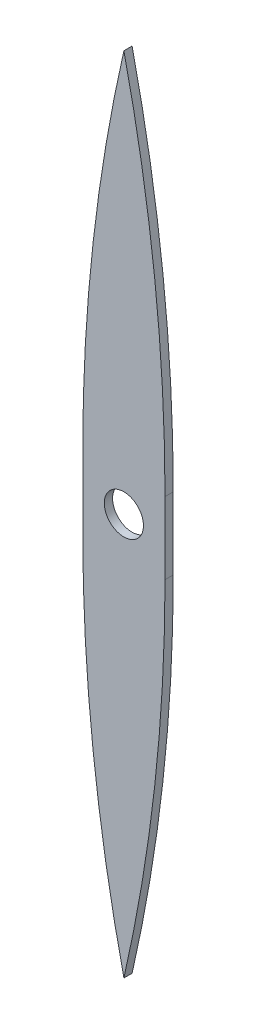
ISO-10303-21;
HEADER;
FILE_DESCRIPTION(('STEP AP214'),'2;1');
FILE_NAME('part.step','',(''),(''),'','','');
FILE_SCHEMA(('AUTOMOTIVE_DESIGN { 1 0 10303 214 1 1 1 1 }'));
ENDSEC;
DATA;
#1=APPLICATION_CONTEXT('core data for automotive mechanical design processes');
#2=APPLICATION_PROTOCOL_DEFINITION('international standard','automotive_design',2000,#1);
#3=PRODUCT_CONTEXT('',#1,'mechanical');
#4=PRODUCT('Part','Part','',(#3));
#5=PRODUCT_RELATED_PRODUCT_CATEGORY('part','',(#4));
#6=PRODUCT_DEFINITION_FORMATION('','',#4);
#7=PRODUCT_DEFINITION_CONTEXT('part definition',#1,'design');
#8=PRODUCT_DEFINITION('design','',#6,#7);
#9=PRODUCT_DEFINITION_SHAPE('','',#8);
#10=(LENGTH_UNIT() NAMED_UNIT(*) SI_UNIT(.MILLI.,.METRE.));
#11=(NAMED_UNIT(*) PLANE_ANGLE_UNIT() SI_UNIT($,.RADIAN.));
#12=(NAMED_UNIT(*) SI_UNIT($,.STERADIAN.) SOLID_ANGLE_UNIT());
#13=UNCERTAINTY_MEASURE_WITH_UNIT(LENGTH_MEASURE(1.E-05),#10,'distance_accuracy_value','');
#14=(GEOMETRIC_REPRESENTATION_CONTEXT(3) GLOBAL_UNCERTAINTY_ASSIGNED_CONTEXT((#13)) GLOBAL_UNIT_ASSIGNED_CONTEXT((#10,
#11,#12)) REPRESENTATION_CONTEXT('',''));
#15=CARTESIAN_POINT('',(0.,0.,0.));
#16=DIRECTION('',(0.,0.,1.));
#17=DIRECTION('',(1.,0.,0.));
#18=AXIS2_PLACEMENT_3D('',#15,#16,#17);
#19=CARTESIAN_POINT('',(-390.,13.8203629652415,2.));
#20=DIRECTION('',(0.,0.,-1.));
#21=DIRECTION('',(-1.,0.,0.));
#22=AXIS2_PLACEMENT_3D('',#19,#20,#21);
#23=CYLINDRICAL_SURFACE('',#22,400.);
#24=CARTESIAN_POINT('',(-390.,13.8203629652415,0.));
#25=DIRECTION('',(0.,0.,1.));
#26=DIRECTION('',(1.,0.,0.));
#27=AXIS2_PLACEMENT_3D('',#24,#25,#26);
#28=CIRCLE('',#27,400.);
#29=CARTESIAN_POINT('',(10.,13.8203629652415,0.));
#30=VERTEX_POINT('',#29);
#31=CARTESIAN_POINT('',(0.,102.702307138397,0.));
#32=VERTEX_POINT('',#31);
#33=EDGE_CURVE('E137',#30,#32,#28,.T.);
#34=ORIENTED_EDGE('',*,*,#33,.T.);
#35=DIRECTION('',(0.,0.,-1.));
#36=VECTOR('',#35,1.);
#37=CARTESIAN_POINT('',(0.,102.702307138397,2.));
#38=LINE('',#37,#36);
#39=CARTESIAN_POINT('',(0.,102.702307138397,2.));
#40=VERTEX_POINT('',#39);
#41=EDGE_CURVE('E11',#40,#32,#38,.T.);
#42=ORIENTED_EDGE('',*,*,#41,.F.);
#43=CARTESIAN_POINT('',(-390.,13.8203629652415,2.));
#44=DIRECTION('',(0.,0.,1.));
#45=DIRECTION('',(1.,0.,0.));
#46=AXIS2_PLACEMENT_3D('',#43,#44,#45);
#47=CIRCLE('',#46,400.);
#48=CARTESIAN_POINT('',(10.,13.8203629652415,2.));
#49=VERTEX_POINT('',#48);
#50=EDGE_CURVE('E157',#49,#40,#47,.T.);
#51=ORIENTED_EDGE('',*,*,#50,.F.);
#52=DIRECTION('',(0.,0.,-1.));
#53=VECTOR('',#52,1.);
#54=CARTESIAN_POINT('',(10.,13.8203629652415,2.));
#55=LINE('',#54,#53);
#56=EDGE_CURVE('E133',#49,#30,#55,.T.);
#57=ORIENTED_EDGE('',*,*,#56,.T.);
#58=EDGE_LOOP('',(#34,#42,#51,#57));
#59=FACE_BOUND('',#58,.T.);
#60=ADVANCED_FACE('F41',(#59),#23,.T.);
#61=CARTESIAN_POINT('',(390.,13.8203629652415,2.));
#62=DIRECTION('',(0.,0.,-1.));
#63=DIRECTION('',(-1.,0.,0.));
#64=AXIS2_PLACEMENT_3D('',#61,#62,#63);
#65=CYLINDRICAL_SURFACE('',#64,400.);
#66=CARTESIAN_POINT('',(390.,13.8203629652415,0.));
#67=DIRECTION('',(0.,0.,1.));
#68=DIRECTION('',(-1.,0.,0.));
#69=AXIS2_PLACEMENT_3D('',#66,#67,#68);
#70=CIRCLE('',#69,400.);
#71=CARTESIAN_POINT('',(-10.,13.8203629652415,0.));
#72=VERTEX_POINT('',#71);
#73=EDGE_CURVE('E141',#32,#72,#70,.T.);
#74=ORIENTED_EDGE('',*,*,#73,.T.);
#75=DIRECTION('',(0.,0.,-1.));
#76=VECTOR('',#75,1.);
#77=CARTESIAN_POINT('',(-10.,13.8203629652415,2.));
#78=LINE('',#77,#76);
#79=CARTESIAN_POINT('',(-10.,13.8203629652415,2.));
#80=VERTEX_POINT('',#79);
#81=EDGE_CURVE('E51',#80,#72,#78,.T.);
#82=ORIENTED_EDGE('',*,*,#81,.F.);
#83=CARTESIAN_POINT('',(390.,13.8203629652415,2.));
#84=DIRECTION('',(0.,0.,1.));
#85=DIRECTION('',(-1.,0.,0.));
#86=AXIS2_PLACEMENT_3D('',#83,#84,#85);
#87=CIRCLE('',#86,400.);
#88=EDGE_CURVE('E99',#40,#80,#87,.T.);
#89=ORIENTED_EDGE('',*,*,#88,.F.);
#90=ORIENTED_EDGE('',*,*,#41,.T.);
#91=EDGE_LOOP('',(#74,#82,#89,#90));
#92=FACE_BOUND('',#91,.T.);
#93=ADVANCED_FACE('F212',(#92),#65,.T.);
#94=CARTESIAN_POINT('',(-10.,-3.67963703475854,2.));
#95=DIRECTION('',(1.,0.,0.));
#96=DIRECTION('',(0.,0.,-1.));
#97=AXIS2_PLACEMENT_3D('',#94,#95,#96);
#98=PLANE('',#97);
#99=DIRECTION('',(0.,-1.,0.));
#100=VECTOR('',#99,1.);
#101=CARTESIAN_POINT('',(-10.,-3.67963703475854,0.));
#102=LINE('',#101,#100);
#103=CARTESIAN_POINT('',(-10.,-3.67963703475849,0.));
#104=VERTEX_POINT('',#103);
#105=EDGE_CURVE('E145',#72,#104,#102,.T.);
#106=ORIENTED_EDGE('',*,*,#105,.T.);
#107=DIRECTION('',(0.,0.,-1.));
#108=VECTOR('',#107,1.);
#109=CARTESIAN_POINT('',(-10.,-3.67963703475849,2.));
#110=LINE('',#109,#108);
#111=CARTESIAN_POINT('',(-10.,-3.67963703475849,2.));
#112=VERTEX_POINT('',#111);
#113=EDGE_CURVE('E164',#112,#104,#110,.T.);
#114=ORIENTED_EDGE('',*,*,#113,.F.);
#115=DIRECTION('',(0.,-1.,0.));
#116=VECTOR('',#115,1.);
#117=CARTESIAN_POINT('',(-10.,-3.67963703475854,2.));
#118=LINE('',#117,#116);
#119=EDGE_CURVE('E175',#80,#112,#118,.T.);
#120=ORIENTED_EDGE('',*,*,#119,.F.);
#121=ORIENTED_EDGE('',*,*,#81,.T.);
#122=EDGE_LOOP('',(#106,#114,#120,#121));
#123=FACE_BOUND('',#122,.T.);
#124=ADVANCED_FACE('F173',(#123),#98,.F.);
#125=CARTESIAN_POINT('',(390.,-3.67963703475854,2.));
#126=DIRECTION('',(0.,0.,-1.));
#127=DIRECTION('',(-1.,0.,0.));
#128=AXIS2_PLACEMENT_3D('',#125,#126,#127);
#129=CYLINDRICAL_SURFACE('',#128,400.);
#130=CARTESIAN_POINT('',(390.,-3.67963703475854,0.));
#131=DIRECTION('',(0.,0.,1.));
#132=DIRECTION('',(1.,0.,0.));
#133=AXIS2_PLACEMENT_3D('',#130,#131,#132);
#134=CIRCLE('',#133,400.);
#135=CARTESIAN_POINT('',(-0.00130367095478889,-92.5558607110362,0.));
#136=VERTEX_POINT('',#135);
#137=EDGE_CURVE('E148',#104,#136,#134,.T.);
#138=ORIENTED_EDGE('',*,*,#137,.T.);
#139=DIRECTION('',(0.,0.,-1.));
#140=VECTOR('',#139,1.);
#141=CARTESIAN_POINT('',(-0.00130367095478889,-92.5558607110362,2.));
#142=LINE('',#141,#140);
#143=CARTESIAN_POINT('',(-0.00130367095478889,-92.5558607110362,2.));
#144=VERTEX_POINT('',#143);
#145=EDGE_CURVE('E126',#144,#136,#142,.T.);
#146=ORIENTED_EDGE('',*,*,#145,.F.);
#147=CARTESIAN_POINT('',(390.,-3.67963703475854,2.));
#148=DIRECTION('',(0.,0.,1.));
#149=DIRECTION('',(1.,0.,0.));
#150=AXIS2_PLACEMENT_3D('',#147,#148,#149);
#151=CIRCLE('',#150,400.);
#152=EDGE_CURVE('E115',#112,#144,#151,.T.);
#153=ORIENTED_EDGE('',*,*,#152,.F.);
#154=ORIENTED_EDGE('',*,*,#113,.T.);
#155=EDGE_LOOP('',(#138,#146,#153,#154));
#156=FACE_BOUND('',#155,.T.);
#157=ADVANCED_FACE('F181',(#156),#129,.T.);
#158=CARTESIAN_POINT('',(-0.00130367095478889,-92.5558607110362,2.));
#159=DIRECTION('',(-5.32258073136306E-12,1.,0.));
#160=DIRECTION('',(-1.,-5.32258073136306E-12,0.));
#161=AXIS2_PLACEMENT_3D('',#158,#159,#160);
#162=PLANE('',#161);
#163=DIRECTION('',(1.,5.32258073136306E-12,0.));
#164=VECTOR('',#163,1.);
#165=CARTESIAN_POINT('',(-0.00130367095478889,-92.5558607110362,0.));
#166=LINE('',#165,#164);
#167=CARTESIAN_POINT('',(0.00130367095479977,-92.5558607110361,0.));
#168=VERTEX_POINT('',#167);
#169=EDGE_CURVE('E124',#136,#168,#166,.T.);
#170=ORIENTED_EDGE('',*,*,#169,.T.);
#171=DIRECTION('',(0.,0.,-1.));
#172=VECTOR('',#171,1.);
#173=CARTESIAN_POINT('',(0.00130367095479977,-92.5558607110361,2.));
#174=LINE('',#173,#172);
#175=CARTESIAN_POINT('',(0.00130367095479977,-92.5558607110361,2.));
#176=VERTEX_POINT('',#175);
#177=EDGE_CURVE('E121',#176,#168,#174,.T.);
#178=ORIENTED_EDGE('',*,*,#177,.F.);
#179=DIRECTION('',(1.,5.32258073136306E-12,0.));
#180=VECTOR('',#179,1.);
#181=CARTESIAN_POINT('',(-0.00130367095478889,-92.5558607110362,2.));
#182=LINE('',#181,#180);
#183=EDGE_CURVE('E109',#144,#176,#182,.T.);
#184=ORIENTED_EDGE('',*,*,#183,.F.);
#185=ORIENTED_EDGE('',*,*,#145,.T.);
#186=EDGE_LOOP('',(#170,#178,#184,#185));
#187=FACE_BOUND('',#186,.T.);
#188=ADVANCED_FACE('F122',(#187),#162,.F.);
#189=CARTESIAN_POINT('',(-390.,-3.67963703475854,2.));
#190=DIRECTION('',(0.,0.,-1.));
#191=DIRECTION('',(-1.,0.,0.));
#192=AXIS2_PLACEMENT_3D('',#189,#190,#191);
#193=CYLINDRICAL_SURFACE('',#192,400.);
#194=CARTESIAN_POINT('',(-390.,-3.67963703475854,0.));
#195=DIRECTION('',(0.,0.,1.));
#196=DIRECTION('',(-1.,0.,0.));
#197=AXIS2_PLACEMENT_3D('',#194,#195,#196);
#198=CIRCLE('',#197,400.);
#199=CARTESIAN_POINT('',(10.,-3.67963703475854,0.));
#200=VERTEX_POINT('',#199);
#201=EDGE_CURVE('E85',#168,#200,#198,.T.);
#202=ORIENTED_EDGE('',*,*,#201,.T.);
#203=DIRECTION('',(0.,0.,-1.));
#204=VECTOR('',#203,1.);
#205=CARTESIAN_POINT('',(10.,-3.67963703475854,2.));
#206=LINE('',#205,#204);
#207=CARTESIAN_POINT('',(10.,-3.67963703475854,2.));
#208=VERTEX_POINT('',#207);
#209=EDGE_CURVE('E127',#208,#200,#206,.T.);
#210=ORIENTED_EDGE('',*,*,#209,.F.);
#211=CARTESIAN_POINT('',(-390.,-3.67963703475854,2.));
#212=DIRECTION('',(0.,0.,1.));
#213=DIRECTION('',(-1.,0.,0.));
#214=AXIS2_PLACEMENT_3D('',#211,#212,#213);
#215=CIRCLE('',#214,400.);
#216=EDGE_CURVE('E113',#176,#208,#215,.T.);
#217=ORIENTED_EDGE('',*,*,#216,.F.);
#218=ORIENTED_EDGE('',*,*,#177,.T.);
#219=EDGE_LOOP('',(#202,#210,#217,#218));
#220=FACE_BOUND('',#219,.T.);
#221=ADVANCED_FACE('F129',(#220),#193,.T.);
#222=CARTESIAN_POINT('',(10.,-3.67963703475854,2.));
#223=DIRECTION('',(-1.,0.,0.));
#224=DIRECTION('',(0.,0.,1.));
#225=AXIS2_PLACEMENT_3D('',#222,#223,#224);
#226=PLANE('',#225);
#227=DIRECTION('',(0.,1.,0.));
#228=VECTOR('',#227,1.);
#229=CARTESIAN_POINT('',(10.,-3.67963703475854,0.));
#230=LINE('',#229,#228);
#231=EDGE_CURVE('E91',#200,#30,#230,.T.);
#232=ORIENTED_EDGE('',*,*,#231,.T.);
#233=ORIENTED_EDGE('',*,*,#56,.F.);
#234=DIRECTION('',(0.,1.,0.));
#235=VECTOR('',#234,1.);
#236=CARTESIAN_POINT('',(10.,-3.67963703475854,2.));
#237=LINE('',#236,#235);
#238=EDGE_CURVE('E59',#208,#49,#237,.T.);
#239=ORIENTED_EDGE('',*,*,#238,.F.);
#240=ORIENTED_EDGE('',*,*,#209,.T.);
#241=EDGE_LOOP('',(#232,#233,#239,#240));
#242=FACE_BOUND('',#241,.T.);
#243=ADVANCED_FACE('F208',(#242),#226,.F.);
#244=CARTESIAN_POINT('',(-390.,13.8203629652415,2.));
#245=DIRECTION('',(0.,0.,1.));
#246=DIRECTION('',(1.,0.,0.));
#247=AXIS2_PLACEMENT_3D('',#244,#245,#246);
#248=PLANE('',#247);
#249=CARTESIAN_POINT('',(0.000651835477399887,5.07322321368069,2.));
#250=DIRECTION('',(0.,0.,1.));
#251=DIRECTION('',(1.,0.,0.));
#252=AXIS2_PLACEMENT_3D('',#249,#250,#251);
#253=CIRCLE('',#252,4.76);
#254=CARTESIAN_POINT('',(4.7606518354774,5.07322321368069,2.));
#255=VERTEX_POINT('',#254);
#256=EDGE_CURVE('E142',#255,#255,#253,.F.);
#257=ORIENTED_EDGE('',*,*,#256,.T.);
#258=EDGE_LOOP('',(#257));
#259=FACE_BOUND('',#258,.T.);
#260=ORIENTED_EDGE('',*,*,#50,.T.);
#261=ORIENTED_EDGE('',*,*,#88,.T.);
#262=ORIENTED_EDGE('',*,*,#119,.T.);
#263=ORIENTED_EDGE('',*,*,#152,.T.);
#264=ORIENTED_EDGE('',*,*,#183,.T.);
#265=ORIENTED_EDGE('',*,*,#216,.T.);
#266=ORIENTED_EDGE('',*,*,#238,.T.);
#267=EDGE_LOOP('',(#260,#261,#262,#263,#264,#265,#266));
#268=FACE_BOUND('',#267,.T.);
#269=ADVANCED_FACE('F111',(#259,#268),#248,.T.);
#270=CARTESIAN_POINT('',(-390.,13.8203629652415,0.));
#271=DIRECTION('',(0.,0.,1.));
#272=DIRECTION('',(1.,0.,0.));
#273=AXIS2_PLACEMENT_3D('',#270,#271,#272);
#274=PLANE('',#273);
#275=CARTESIAN_POINT('',(0.000651835477399887,5.07322321368069,0.));
#276=DIRECTION('',(0.,0.,1.));
#277=DIRECTION('',(1.,0.,0.));
#278=AXIS2_PLACEMENT_3D('',#275,#276,#277);
#279=CIRCLE('',#278,4.76);
#280=CARTESIAN_POINT('',(4.7606518354774,5.07322321368069,0.));
#281=VERTEX_POINT('',#280);
#282=EDGE_CURVE('E44',#281,#281,#279,.F.);
#283=ORIENTED_EDGE('',*,*,#282,.F.);
#284=EDGE_LOOP('',(#283));
#285=FACE_BOUND('',#284,.T.);
#286=ORIENTED_EDGE('',*,*,#33,.F.);
#287=ORIENTED_EDGE('',*,*,#231,.F.);
#288=ORIENTED_EDGE('',*,*,#201,.F.);
#289=ORIENTED_EDGE('',*,*,#169,.F.);
#290=ORIENTED_EDGE('',*,*,#137,.F.);
#291=ORIENTED_EDGE('',*,*,#105,.F.);
#292=ORIENTED_EDGE('',*,*,#73,.F.);
#293=EDGE_LOOP('',(#286,#287,#288,#289,#290,#291,#292));
#294=FACE_BOUND('',#293,.T.);
#295=ADVANCED_FACE('F179',(#285,#294),#274,.F.);
#296=CARTESIAN_POINT('',(0.000651835477399887,5.07322321368069,-15.));
#297=DIRECTION('',(0.,0.,1.));
#298=DIRECTION('',(1.,0.,0.));
#299=AXIS2_PLACEMENT_3D('',#296,#297,#298);
#300=CYLINDRICAL_SURFACE('',#299,4.76);
#301=ORIENTED_EDGE('',*,*,#256,.F.);
#302=EDGE_LOOP('',(#301));
#303=FACE_BOUND('',#302,.T.);
#304=ORIENTED_EDGE('',*,*,#282,.T.);
#305=EDGE_LOOP('',(#304));
#306=FACE_BOUND('',#305,.T.);
#307=ADVANCED_FACE('F198',(#303,#306),#300,.F.);
#308=CLOSED_SHELL('',(#60,#93,#124,#157,#188,#221,#243,#269,#295,#307));
#309=MANIFOLD_SOLID_BREP('B2',#308);
#310=ADVANCED_BREP_SHAPE_REPRESENTATION('',(#18,#309),#14);
#311=SHAPE_DEFINITION_REPRESENTATION(#9,#310);
ENDSEC;
END-ISO-10303-21;
